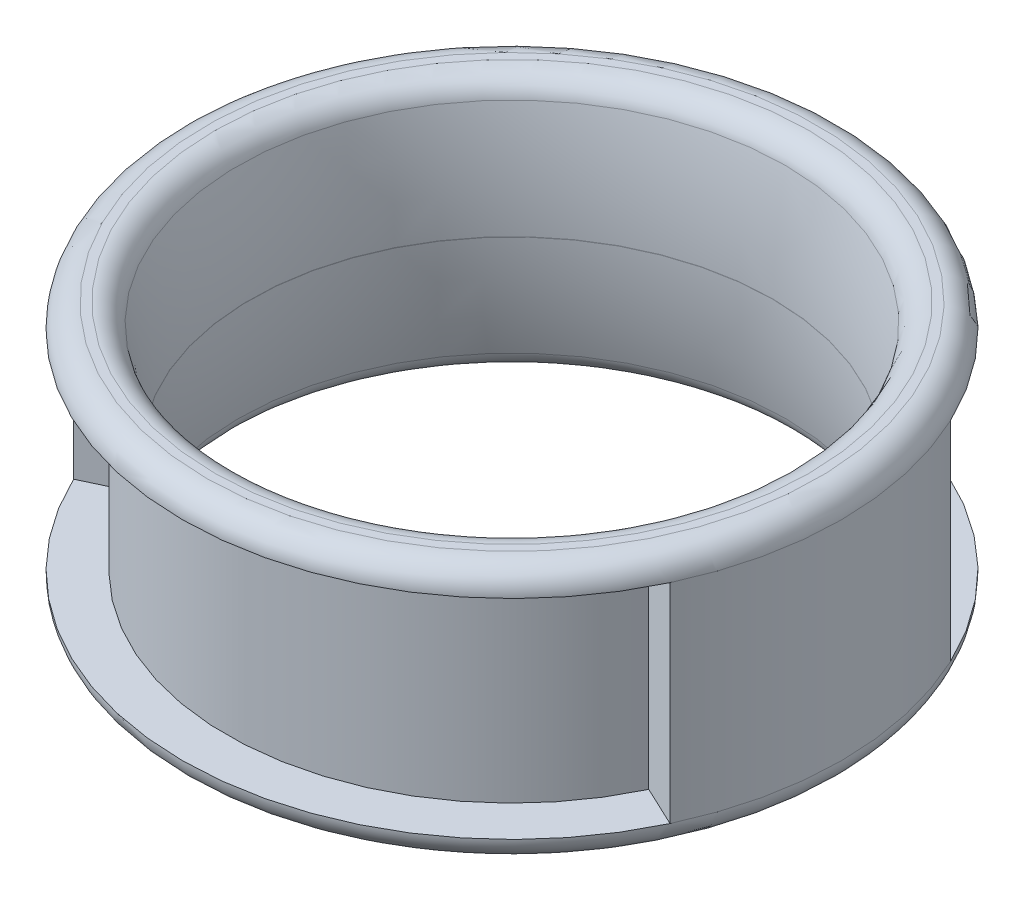
ISO-10303-21;
HEADER;
FILE_DESCRIPTION(('STEP AP214'),'2;1');
FILE_NAME('part.step','',(''),(''),'','','');
FILE_SCHEMA(('AUTOMOTIVE_DESIGN { 1 0 10303 214 1 1 1 1 }'));
ENDSEC;
DATA;
#1=APPLICATION_CONTEXT('core data for automotive mechanical design processes');
#2=APPLICATION_PROTOCOL_DEFINITION('international standard','automotive_design',2000,#1);
#3=PRODUCT_CONTEXT('',#1,'mechanical');
#4=PRODUCT('Part','Part','',(#3));
#5=PRODUCT_RELATED_PRODUCT_CATEGORY('part','',(#4));
#6=PRODUCT_DEFINITION_FORMATION('','',#4);
#7=PRODUCT_DEFINITION_CONTEXT('part definition',#1,'design');
#8=PRODUCT_DEFINITION('design','',#6,#7);
#9=PRODUCT_DEFINITION_SHAPE('','',#8);
#10=(LENGTH_UNIT() NAMED_UNIT(*) SI_UNIT(.MILLI.,.METRE.));
#11=(NAMED_UNIT(*) PLANE_ANGLE_UNIT() SI_UNIT($,.RADIAN.));
#12=(NAMED_UNIT(*) SI_UNIT($,.STERADIAN.) SOLID_ANGLE_UNIT());
#13=UNCERTAINTY_MEASURE_WITH_UNIT(LENGTH_MEASURE(1.E-05),#10,'distance_accuracy_value','');
#14=(GEOMETRIC_REPRESENTATION_CONTEXT(3) GLOBAL_UNCERTAINTY_ASSIGNED_CONTEXT((#13)) GLOBAL_UNIT_ASSIGNED_CONTEXT((#10,
#11,#12)) REPRESENTATION_CONTEXT('',''));
#15=CARTESIAN_POINT('',(0.,0.,0.));
#16=DIRECTION('',(0.,0.,1.));
#17=DIRECTION('',(1.,0.,0.));
#18=AXIS2_PLACEMENT_3D('',#15,#16,#17);
#19=CARTESIAN_POINT('',(0.,-3.75,0.));
#20=DIRECTION('',(0.,1.,0.));
#21=DIRECTION('',(0.,0.,1.));
#22=AXIS2_PLACEMENT_3D('',#19,#20,#21);
#23=CYLINDRICAL_SURFACE('',#22,9.635);
#24=CARTESIAN_POINT('',(0.,-3.05,0.));
#25=DIRECTION('',(0.,1.,0.));
#26=DIRECTION('',(0.,0.,1.));
#27=AXIS2_PLACEMENT_3D('',#24,#25,#26);
#28=CIRCLE('',#27,9.635);
#29=CARTESIAN_POINT('',(-8.71979782303053,-3.05,-4.09857913495298));
#30=VERTEX_POINT('',#29);
#31=CARTESIAN_POINT('',(-8.71979782303053,-3.05,4.09857913495298));
#32=VERTEX_POINT('',#31);
#33=EDGE_CURVE('E168',#30,#32,#28,.T.);
#34=ORIENTED_EDGE('',*,*,#33,.T.);
#35=DIRECTION('',(0.,1.,0.));
#36=VECTOR('',#35,1.);
#37=CARTESIAN_POINT('',(-8.71979782303053,3.05,4.09857913495298));
#38=LINE('',#37,#36);
#39=CARTESIAN_POINT('',(-8.71979782303053,3.05,4.09857913495298));
#40=VERTEX_POINT('',#39);
#41=EDGE_CURVE('E235',#32,#40,#38,.T.);
#42=ORIENTED_EDGE('',*,*,#41,.T.);
#43=CARTESIAN_POINT('',(0.,3.05,0.));
#44=DIRECTION('',(0.,1.,0.));
#45=DIRECTION('',(0.,0.,1.));
#46=AXIS2_PLACEMENT_3D('',#43,#44,#45);
#47=CIRCLE('',#46,9.635);
#48=CARTESIAN_POINT('',(-8.71979782303053,3.05,-4.09857913495298));
#49=VERTEX_POINT('',#48);
#50=EDGE_CURVE('E58',#40,#49,#47,.F.);
#51=ORIENTED_EDGE('',*,*,#50,.T.);
#52=DIRECTION('',(0.,1.,0.));
#53=VECTOR('',#52,1.);
#54=CARTESIAN_POINT('',(-8.71979782303053,3.05,-4.09857913495298));
#55=LINE('',#54,#53);
#56=EDGE_CURVE('E137',#30,#49,#55,.T.);
#57=ORIENTED_EDGE('',*,*,#56,.F.);
#58=EDGE_LOOP('',(#34,#42,#51,#57));
#59=FACE_BOUND('',#58,.T.);
#60=ADVANCED_FACE('F35',(#59),#23,.T.);
#61=CARTESIAN_POINT('',(0.,-3.75,0.));
#62=DIRECTION('',(0.,1.,0.));
#63=DIRECTION('',(0.,0.,1.));
#64=AXIS2_PLACEMENT_3D('',#61,#62,#63);
#65=CYLINDRICAL_SURFACE('',#64,7.635);
#66=CARTESIAN_POINT('',(0.,0.0049999999999998,0.));
#67=DIRECTION('',(0.,-1.,0.));
#68=DIRECTION('',(0.,0.,-1.));
#69=AXIS2_PLACEMENT_3D('',#66,#67,#68);
#70=CIRCLE('',#69,7.635);
#71=CARTESIAN_POINT('',(0.,0.0049999999999998,-7.635));
#72=VERTEX_POINT('',#71);
#73=EDGE_CURVE('E158',#72,#72,#70,.T.);
#74=ORIENTED_EDGE('',*,*,#73,.F.);
#75=EDGE_LOOP('',(#74));
#76=FACE_BOUND('',#75,.T.);
#77=CARTESIAN_POINT('',(0.,-0.00500000000000148,0.));
#78=DIRECTION('',(0.,-1.,0.));
#79=DIRECTION('',(0.,0.,-1.));
#80=AXIS2_PLACEMENT_3D('',#77,#78,#79);
#81=CIRCLE('',#80,7.635);
#82=CARTESIAN_POINT('',(0.,-0.00500000000000148,-7.635));
#83=VERTEX_POINT('',#82);
#84=EDGE_CURVE('E155',#83,#83,#81,.T.);
#85=ORIENTED_EDGE('',*,*,#84,.T.);
#86=EDGE_LOOP('',(#85));
#87=FACE_BOUND('',#86,.T.);
#88=ADVANCED_FACE('F200',(#76,#87),#65,.F.);
#89=CARTESIAN_POINT('',(0.,-3.75,0.));
#90=DIRECTION('',(0.,1.,0.));
#91=DIRECTION('',(0.,0.,1.));
#92=AXIS2_PLACEMENT_3D('',#89,#90,#91);
#93=PLANE('',#92);
#94=CARTESIAN_POINT('',(0.,-3.75,0.));
#95=DIRECTION('',(0.,1.,0.));
#96=DIRECTION('',(0.,0.,1.));
#97=AXIS2_PLACEMENT_3D('',#94,#95,#96);
#98=CIRCLE('',#97,8.68408216759765);
#99=CARTESIAN_POINT('',(0.,-3.75,8.68408216759765));
#100=VERTEX_POINT('',#99);
#101=EDGE_CURVE('E177',#100,#100,#98,.T.);
#102=ORIENTED_EDGE('',*,*,#101,.T.);
#103=EDGE_LOOP('',(#102));
#104=FACE_BOUND('',#103,.T.);
#105=CARTESIAN_POINT('',(0.,-3.75,0.));
#106=DIRECTION('',(0.,1.,0.));
#107=DIRECTION('',(0.,0.,1.));
#108=AXIS2_PLACEMENT_3D('',#105,#106,#107);
#109=CIRCLE('',#108,8.935);
#110=CARTESIAN_POINT('',(0.,-3.75,8.935));
#111=VERTEX_POINT('',#110);
#112=EDGE_CURVE('E167',#111,#111,#109,.F.);
#113=ORIENTED_EDGE('',*,*,#112,.T.);
#114=EDGE_LOOP('',(#113));
#115=FACE_BOUND('',#114,.T.);
#116=ADVANCED_FACE('F206',(#104,#115),#93,.F.);
#117=CARTESIAN_POINT('',(0.,3.75,0.));
#118=DIRECTION('',(0.,1.,0.));
#119=DIRECTION('',(0.,0.,1.));
#120=AXIS2_PLACEMENT_3D('',#117,#118,#119);
#121=PLANE('',#120);
#122=CARTESIAN_POINT('',(0.,3.75,0.));
#123=DIRECTION('',(0.,1.,0.));
#124=DIRECTION('',(0.,0.,1.));
#125=AXIS2_PLACEMENT_3D('',#122,#123,#124);
#126=CIRCLE('',#125,8.68408216759765);
#127=CARTESIAN_POINT('',(0.,3.75,8.68408216759765));
#128=VERTEX_POINT('',#127);
#129=EDGE_CURVE('E43',#128,#128,#126,.F.);
#130=ORIENTED_EDGE('',*,*,#129,.T.);
#131=EDGE_LOOP('',(#130));
#132=FACE_BOUND('',#131,.T.);
#133=CARTESIAN_POINT('',(0.,3.75,0.));
#134=DIRECTION('',(0.,1.,0.));
#135=DIRECTION('',(0.,0.,1.));
#136=AXIS2_PLACEMENT_3D('',#133,#134,#135);
#137=CIRCLE('',#136,8.935);
#138=CARTESIAN_POINT('',(0.,3.75,8.935));
#139=VERTEX_POINT('',#138);
#140=EDGE_CURVE('E171',#139,#139,#137,.T.);
#141=ORIENTED_EDGE('',*,*,#140,.T.);
#142=EDGE_LOOP('',(#141));
#143=FACE_BOUND('',#142,.T.);
#144=ADVANCED_FACE('F182',(#132,#143),#121,.T.);
#145=DIRECTION('',(0.,1.,0.));
#146=VECTOR('',#145,1.);
#147=CARTESIAN_POINT('',(8.71979782303053,3.05,4.09857913495298));
#148=LINE('',#147,#146);
#149=CARTESIAN_POINT('',(8.71979782303053,-3.05,4.09857913495298));
#150=VERTEX_POINT('',#149);
#151=CARTESIAN_POINT('',(8.71979782303054,3.05,4.09857913495298));
#152=VERTEX_POINT('',#151);
#153=EDGE_CURVE('E224',#150,#152,#148,.T.);
#154=ORIENTED_EDGE('',*,*,#153,.F.);
#155=CARTESIAN_POINT('',(8.71979782303053,-3.05,-4.09857913495298));
#156=VERTEX_POINT('',#155);
#157=EDGE_CURVE('E163',#150,#156,#28,.T.);
#158=ORIENTED_EDGE('',*,*,#157,.T.);
#159=DIRECTION('',(0.,1.,0.));
#160=VECTOR('',#159,1.);
#161=CARTESIAN_POINT('',(8.71979782303053,3.05,-4.09857913495298));
#162=LINE('',#161,#160);
#163=CARTESIAN_POINT('',(8.71979782303053,3.05,-4.09857913495298));
#164=VERTEX_POINT('',#163);
#165=EDGE_CURVE('E148',#156,#164,#162,.T.);
#166=ORIENTED_EDGE('',*,*,#165,.T.);
#167=EDGE_CURVE('E164',#164,#152,#47,.F.);
#168=ORIENTED_EDGE('',*,*,#167,.T.);
#169=EDGE_LOOP('',(#154,#158,#166,#168));
#170=FACE_BOUND('',#169,.T.);
#171=ADVANCED_FACE('F202',(#170),#23,.T.);
#172=CARTESIAN_POINT('',(0.,-3.05,0.));
#173=DIRECTION('',(0.,1.,0.));
#174=DIRECTION('',(0.,0.,1.));
#175=AXIS2_PLACEMENT_3D('',#172,#173,#174);
#176=TOROIDAL_SURFACE('',#175,8.935,0.7);
#177=ORIENTED_EDGE('',*,*,#112,.F.);
#178=EDGE_LOOP('',(#177));
#179=FACE_BOUND('',#178,.T.);
#180=EDGE_CURVE('E165',#156,#30,#28,.T.);
#181=ORIENTED_EDGE('',*,*,#180,.F.);
#182=ORIENTED_EDGE('',*,*,#157,.F.);
#183=CARTESIAN_POINT('',(0.,-3.05,0.));
#184=DIRECTION('',(0.,-1.,0.));
#185=DIRECTION('',(0.,0.,-1.));
#186=AXIS2_PLACEMENT_3D('',#183,#184,#185);
#187=CIRCLE('',#186,9.635);
#188=EDGE_CURVE('E128',#150,#32,#187,.T.);
#189=ORIENTED_EDGE('',*,*,#188,.T.);
#190=ORIENTED_EDGE('',*,*,#33,.F.);
#191=EDGE_LOOP('',(#181,#182,#189,#190));
#192=FACE_BOUND('',#191,.T.);
#193=ADVANCED_FACE('F213',(#179,#192),#176,.T.);
#194=CARTESIAN_POINT('',(0.,3.05,0.));
#195=DIRECTION('',(0.,1.,0.));
#196=DIRECTION('',(0.,0.,1.));
#197=AXIS2_PLACEMENT_3D('',#194,#195,#196);
#198=TOROIDAL_SURFACE('',#197,8.935,0.7);
#199=EDGE_CURVE('E161',#49,#164,#47,.F.);
#200=ORIENTED_EDGE('',*,*,#199,.F.);
#201=ORIENTED_EDGE('',*,*,#50,.F.);
#202=CARTESIAN_POINT('',(0.,3.05,0.));
#203=DIRECTION('',(0.,-1.,0.));
#204=DIRECTION('',(0.,0.,-1.));
#205=AXIS2_PLACEMENT_3D('',#202,#203,#204);
#206=CIRCLE('',#205,9.635);
#207=EDGE_CURVE('E117',#152,#40,#206,.T.);
#208=ORIENTED_EDGE('',*,*,#207,.F.);
#209=ORIENTED_EDGE('',*,*,#167,.F.);
#210=EDGE_LOOP('',(#200,#201,#208,#209));
#211=FACE_BOUND('',#210,.T.);
#212=ORIENTED_EDGE('',*,*,#140,.F.);
#213=EDGE_LOOP('',(#212));
#214=FACE_BOUND('',#213,.T.);
#215=ADVANCED_FACE('F219',(#211,#214),#198,.T.);
#216=CARTESIAN_POINT('',(0.,-0.0917507307465048,0.));
#217=DIRECTION('',(0.,-1.,0.));
#218=DIRECTION('',(0.,0.,-1.));
#219=AXIS2_PLACEMENT_3D('',#216,#217,#218);
#220=TOROIDAL_SURFACE('',#219,22.6346879732913,15.);
#221=CARTESIAN_POINT('',(0.,3.20379199381277,0.));
#222=DIRECTION('',(0.,-1.,0.));
#223=DIRECTION('',(0.,0.,-1.));
#224=AXIS2_PLACEMENT_3D('',#221,#222,#223);
#225=CIRCLE('',#224,8.00118537990635);
#226=CARTESIAN_POINT('',(0.,3.20379199381277,-8.00118537990635));
#227=VERTEX_POINT('',#226);
#228=EDGE_CURVE('E11',#227,#227,#225,.F.);
#229=ORIENTED_EDGE('',*,*,#228,.T.);
#230=EDGE_LOOP('',(#229));
#231=FACE_BOUND('',#230,.T.);
#232=ORIENTED_EDGE('',*,*,#73,.T.);
#233=EDGE_LOOP('',(#232));
#234=FACE_BOUND('',#233,.T.);
#235=ADVANCED_FACE('F282',(#231,#234),#220,.T.);
#236=CARTESIAN_POINT('',(0.,0.0917507307465016,0.));
#237=DIRECTION('',(0.,-1.,0.));
#238=DIRECTION('',(0.,0.,-1.));
#239=AXIS2_PLACEMENT_3D('',#236,#237,#238);
#240=TOROIDAL_SURFACE('',#239,22.6346879732913,15.);
#241=CARTESIAN_POINT('',(0.,-3.20379199381277,0.));
#242=DIRECTION('',(0.,1.,0.));
#243=DIRECTION('',(0.,0.,1.));
#244=AXIS2_PLACEMENT_3D('',#241,#242,#243);
#245=CIRCLE('',#244,8.00118537990635);
#246=CARTESIAN_POINT('',(0.,-3.20379199381277,8.00118537990635));
#247=VERTEX_POINT('',#246);
#248=EDGE_CURVE('E174',#247,#247,#245,.F.);
#249=ORIENTED_EDGE('',*,*,#248,.T.);
#250=EDGE_LOOP('',(#249));
#251=FACE_BOUND('',#250,.T.);
#252=ORIENTED_EDGE('',*,*,#84,.F.);
#253=EDGE_LOOP('',(#252));
#254=FACE_BOUND('',#253,.T.);
#255=ADVANCED_FACE('F196',(#251,#254),#240,.T.);
#256=CARTESIAN_POINT('',(0.,-3.05,0.));
#257=DIRECTION('',(0.,-1.,0.));
#258=DIRECTION('',(0.,0.,-1.));
#259=AXIS2_PLACEMENT_3D('',#256,#257,#258);
#260=TOROIDAL_SURFACE('',#259,8.68408216759765,0.7);
#261=ORIENTED_EDGE('',*,*,#101,.F.);
#262=EDGE_LOOP('',(#261));
#263=FACE_BOUND('',#262,.T.);
#264=ORIENTED_EDGE('',*,*,#248,.F.);
#265=EDGE_LOOP('',(#264));
#266=FACE_BOUND('',#265,.T.);
#267=ADVANCED_FACE('F187',(#263,#266),#260,.T.);
#268=CARTESIAN_POINT('',(0.,3.05,0.));
#269=DIRECTION('',(0.,-1.,0.));
#270=DIRECTION('',(0.,0.,-1.));
#271=AXIS2_PLACEMENT_3D('',#268,#269,#270);
#272=TOROIDAL_SURFACE('',#271,8.68408216759765,0.7);
#273=ORIENTED_EDGE('',*,*,#228,.F.);
#274=EDGE_LOOP('',(#273));
#275=FACE_BOUND('',#274,.T.);
#276=ORIENTED_EDGE('',*,*,#129,.F.);
#277=EDGE_LOOP('',(#276));
#278=FACE_BOUND('',#277,.T.);
#279=ADVANCED_FACE('F37',(#275,#278),#272,.T.);
#280=CARTESIAN_POINT('',(8.71979782303053,3.05,-4.09857913495298));
#281=DIRECTION('',(0.,-1.,0.));
#282=DIRECTION('',(0.,0.,-1.));
#283=AXIS2_PLACEMENT_3D('',#280,#281,#282);
#284=PLANE('',#283);
#285=CARTESIAN_POINT('',(0.,3.05,0.));
#286=DIRECTION('',(0.,1.,0.));
#287=DIRECTION('',(0.,0.,1.));
#288=AXIS2_PLACEMENT_3D('',#285,#286,#287);
#289=CIRCLE('',#288,8.335);
#290=CARTESIAN_POINT('',(7.54328125116342,3.05,-3.54557935545751));
#291=VERTEX_POINT('',#290);
#292=CARTESIAN_POINT('',(-7.54328125116341,3.05,-3.54557935545751));
#293=VERTEX_POINT('',#292);
#294=EDGE_CURVE('E153',#291,#293,#289,.T.);
#295=ORIENTED_EDGE('',*,*,#294,.T.);
#296=DIRECTION('',(0.905012747590092,0.,0.425384445765748));
#297=VECTOR('',#296,1.);
#298=CARTESIAN_POINT('',(-8.71979782303053,3.05,-4.09857913495298));
#299=LINE('',#298,#297);
#300=EDGE_CURVE('E122',#49,#293,#299,.T.);
#301=ORIENTED_EDGE('',*,*,#300,.F.);
#302=ORIENTED_EDGE('',*,*,#199,.T.);
#303=DIRECTION('',(-0.905012747590092,0.,0.425384445765748));
#304=VECTOR('',#303,1.);
#305=CARTESIAN_POINT('',(8.71979782303053,3.05,-4.09857913495298));
#306=LINE('',#305,#304);
#307=EDGE_CURVE('E139',#164,#291,#306,.T.);
#308=ORIENTED_EDGE('',*,*,#307,.T.);
#309=EDGE_LOOP('',(#295,#301,#302,#308));
#310=FACE_BOUND('',#309,.T.);
#311=ADVANCED_FACE('F186',(#310),#284,.T.);
#312=CARTESIAN_POINT('',(0.,0.,0.));
#313=DIRECTION('',(0.,1.,0.));
#314=DIRECTION('',(0.,0.,1.));
#315=AXIS2_PLACEMENT_3D('',#312,#313,#314);
#316=CYLINDRICAL_SURFACE('',#315,8.335);
#317=CARTESIAN_POINT('',(0.,-3.05,0.));
#318=DIRECTION('',(0.,1.,0.));
#319=DIRECTION('',(0.,0.,1.));
#320=AXIS2_PLACEMENT_3D('',#317,#318,#319);
#321=CIRCLE('',#320,8.335);
#322=CARTESIAN_POINT('',(7.54328125116342,-3.05,-3.54557935545751));
#323=VERTEX_POINT('',#322);
#324=CARTESIAN_POINT('',(-7.54328125116341,-3.05,-3.54557935545751));
#325=VERTEX_POINT('',#324);
#326=EDGE_CURVE('E151',#323,#325,#321,.T.);
#327=ORIENTED_EDGE('',*,*,#326,.T.);
#328=DIRECTION('',(0.,-1.,0.));
#329=VECTOR('',#328,1.);
#330=CARTESIAN_POINT('',(-7.54328125116341,3.05,-3.54557935545751));
#331=LINE('',#330,#329);
#332=EDGE_CURVE('E126',#293,#325,#331,.T.);
#333=ORIENTED_EDGE('',*,*,#332,.F.);
#334=ORIENTED_EDGE('',*,*,#294,.F.);
#335=DIRECTION('',(0.,-1.,0.));
#336=VECTOR('',#335,1.);
#337=CARTESIAN_POINT('',(7.54328125116342,3.05,-3.54557935545751));
#338=LINE('',#337,#336);
#339=EDGE_CURVE('E142',#291,#323,#338,.T.);
#340=ORIENTED_EDGE('',*,*,#339,.T.);
#341=EDGE_LOOP('',(#327,#333,#334,#340));
#342=FACE_BOUND('',#341,.T.);
#343=ADVANCED_FACE('F193',(#342),#316,.T.);
#344=CARTESIAN_POINT('',(8.71979782303053,-3.05,-4.09857913495298));
#345=DIRECTION('',(0.,1.,0.));
#346=DIRECTION('',(0.,0.,1.));
#347=AXIS2_PLACEMENT_3D('',#344,#345,#346);
#348=PLANE('',#347);
#349=ORIENTED_EDGE('',*,*,#180,.T.);
#350=DIRECTION('',(-0.905012747590092,0.,-0.425384445765748));
#351=VECTOR('',#350,1.);
#352=CARTESIAN_POINT('',(-8.71979782303053,-3.05,-4.09857913495298));
#353=LINE('',#352,#351);
#354=EDGE_CURVE('E134',#325,#30,#353,.T.);
#355=ORIENTED_EDGE('',*,*,#354,.F.);
#356=ORIENTED_EDGE('',*,*,#326,.F.);
#357=DIRECTION('',(0.905012747590092,0.,-0.425384445765748));
#358=VECTOR('',#357,1.);
#359=CARTESIAN_POINT('',(8.71979782303053,-3.05,-4.09857913495298));
#360=LINE('',#359,#358);
#361=EDGE_CURVE('E145',#323,#156,#360,.T.);
#362=ORIENTED_EDGE('',*,*,#361,.T.);
#363=EDGE_LOOP('',(#349,#355,#356,#362));
#364=FACE_BOUND('',#363,.T.);
#365=ADVANCED_FACE('F271',(#364),#348,.T.);
#366=CARTESIAN_POINT('',(0.,0.,0.));
#367=DIRECTION('',(0.425384445765748,0.,0.905012747590092));
#368=DIRECTION('',(0.905012747590092,0.,-0.425384445765748));
#369=AXIS2_PLACEMENT_3D('',#366,#367,#368);
#370=PLANE('',#369);
#371=ORIENTED_EDGE('',*,*,#307,.F.);
#372=ORIENTED_EDGE('',*,*,#165,.F.);
#373=ORIENTED_EDGE('',*,*,#361,.F.);
#374=ORIENTED_EDGE('',*,*,#339,.F.);
#375=EDGE_LOOP('',(#371,#372,#373,#374));
#376=FACE_BOUND('',#375,.T.);
#377=ADVANCED_FACE('F269',(#376),#370,.F.);
#378=CARTESIAN_POINT('',(0.,0.,0.));
#379=DIRECTION('',(0.425384445765748,0.,-0.905012747590092));
#380=DIRECTION('',(-0.905012747590092,0.,-0.425384445765748));
#381=AXIS2_PLACEMENT_3D('',#378,#379,#380);
#382=PLANE('',#381);
#383=ORIENTED_EDGE('',*,*,#300,.T.);
#384=ORIENTED_EDGE('',*,*,#332,.T.);
#385=ORIENTED_EDGE('',*,*,#354,.T.);
#386=ORIENTED_EDGE('',*,*,#56,.T.);
#387=EDGE_LOOP('',(#383,#384,#385,#386));
#388=FACE_BOUND('',#387,.T.);
#389=ADVANCED_FACE('F238',(#388),#382,.T.);
#390=CARTESIAN_POINT('',(8.71979782303053,3.05,4.09857913495298));
#391=DIRECTION('',(0.,-1.,0.));
#392=DIRECTION('',(0.,0.,1.));
#393=AXIS2_PLACEMENT_3D('',#390,#391,#392);
#394=PLANE('',#393);
#395=CARTESIAN_POINT('',(0.,3.05,0.));
#396=DIRECTION('',(0.,-1.,0.));
#397=DIRECTION('',(0.,0.,-1.));
#398=AXIS2_PLACEMENT_3D('',#395,#396,#397);
#399=CIRCLE('',#398,8.335);
#400=CARTESIAN_POINT('',(7.54328125116342,3.05,3.54557935545751));
#401=VERTEX_POINT('',#400);
#402=CARTESIAN_POINT('',(-7.54328125116341,3.05,3.54557935545751));
#403=VERTEX_POINT('',#402);
#404=EDGE_CURVE('E115',#401,#403,#399,.T.);
#405=ORIENTED_EDGE('',*,*,#404,.F.);
#406=DIRECTION('',(-0.905012747590092,0.,-0.425384445765748));
#407=VECTOR('',#406,1.);
#408=CARTESIAN_POINT('',(8.71979782303053,3.05,4.09857913495298));
#409=LINE('',#408,#407);
#410=EDGE_CURVE('E50',#152,#401,#409,.T.);
#411=ORIENTED_EDGE('',*,*,#410,.F.);
#412=ORIENTED_EDGE('',*,*,#207,.T.);
#413=DIRECTION('',(0.905012747590092,0.,-0.425384445765748));
#414=VECTOR('',#413,1.);
#415=CARTESIAN_POINT('',(-8.71979782303053,3.05,4.09857913495298));
#416=LINE('',#415,#414);
#417=EDGE_CURVE('E106',#40,#403,#416,.T.);
#418=ORIENTED_EDGE('',*,*,#417,.T.);
#419=EDGE_LOOP('',(#405,#411,#412,#418));
#420=FACE_BOUND('',#419,.T.);
#421=ADVANCED_FACE('F114',(#420),#394,.T.);
#422=CARTESIAN_POINT('',(0.,0.,0.));
#423=DIRECTION('',(0.,1.,0.));
#424=DIRECTION('',(0.,0.,-1.));
#425=AXIS2_PLACEMENT_3D('',#422,#423,#424);
#426=CYLINDRICAL_SURFACE('',#425,8.335);
#427=CARTESIAN_POINT('',(0.,-3.05,0.));
#428=DIRECTION('',(0.,-1.,0.));
#429=DIRECTION('',(0.,0.,-1.));
#430=AXIS2_PLACEMENT_3D('',#427,#428,#429);
#431=CIRCLE('',#430,8.335);
#432=CARTESIAN_POINT('',(7.54328125116342,-3.05,3.54557935545751));
#433=VERTEX_POINT('',#432);
#434=CARTESIAN_POINT('',(-7.54328125116341,-3.05,3.54557935545751));
#435=VERTEX_POINT('',#434);
#436=EDGE_CURVE('E123',#433,#435,#431,.T.);
#437=ORIENTED_EDGE('',*,*,#436,.F.);
#438=DIRECTION('',(0.,-1.,0.));
#439=VECTOR('',#438,1.);
#440=CARTESIAN_POINT('',(7.54328125116342,3.05,3.54557935545751));
#441=LINE('',#440,#439);
#442=EDGE_CURVE('E121',#401,#433,#441,.T.);
#443=ORIENTED_EDGE('',*,*,#442,.F.);
#444=ORIENTED_EDGE('',*,*,#404,.T.);
#445=DIRECTION('',(0.,-1.,0.));
#446=VECTOR('',#445,1.);
#447=CARTESIAN_POINT('',(-7.54328125116341,3.05,3.54557935545751));
#448=LINE('',#447,#446);
#449=EDGE_CURVE('E103',#403,#435,#448,.T.);
#450=ORIENTED_EDGE('',*,*,#449,.T.);
#451=EDGE_LOOP('',(#437,#443,#444,#450));
#452=FACE_BOUND('',#451,.T.);
#453=ADVANCED_FACE('F119',(#452),#426,.T.);
#454=CARTESIAN_POINT('',(8.71979782303053,-3.05,4.09857913495298));
#455=DIRECTION('',(0.,1.,0.));
#456=DIRECTION('',(0.,0.,-1.));
#457=AXIS2_PLACEMENT_3D('',#454,#455,#456);
#458=PLANE('',#457);
#459=ORIENTED_EDGE('',*,*,#188,.F.);
#460=DIRECTION('',(0.905012747590092,0.,0.425384445765748));
#461=VECTOR('',#460,1.);
#462=CARTESIAN_POINT('',(8.71979782303053,-3.05,4.09857913495298));
#463=LINE('',#462,#461);
#464=EDGE_CURVE('E228',#433,#150,#463,.T.);
#465=ORIENTED_EDGE('',*,*,#464,.F.);
#466=ORIENTED_EDGE('',*,*,#436,.T.);
#467=DIRECTION('',(-0.905012747590092,0.,0.425384445765748));
#468=VECTOR('',#467,1.);
#469=CARTESIAN_POINT('',(-8.71979782303053,-3.05,4.09857913495298));
#470=LINE('',#469,#468);
#471=EDGE_CURVE('E108',#435,#32,#470,.T.);
#472=ORIENTED_EDGE('',*,*,#471,.T.);
#473=EDGE_LOOP('',(#459,#465,#466,#472));
#474=FACE_BOUND('',#473,.T.);
#475=ADVANCED_FACE('F252',(#474),#458,.T.);
#476=CARTESIAN_POINT('',(0.,0.,0.));
#477=DIRECTION('',(0.425384445765748,0.,-0.905012747590092));
#478=DIRECTION('',(0.905012747590092,0.,0.425384445765748));
#479=AXIS2_PLACEMENT_3D('',#476,#477,#478);
#480=PLANE('',#479);
#481=ORIENTED_EDGE('',*,*,#410,.T.);
#482=ORIENTED_EDGE('',*,*,#442,.T.);
#483=ORIENTED_EDGE('',*,*,#464,.T.);
#484=ORIENTED_EDGE('',*,*,#153,.T.);
#485=EDGE_LOOP('',(#481,#482,#483,#484));
#486=FACE_BOUND('',#485,.T.);
#487=ADVANCED_FACE('F253',(#486),#480,.F.);
#488=CARTESIAN_POINT('',(0.,0.,0.));
#489=DIRECTION('',(0.425384445765748,0.,0.905012747590092));
#490=DIRECTION('',(-0.905012747590092,0.,0.425384445765748));
#491=AXIS2_PLACEMENT_3D('',#488,#489,#490);
#492=PLANE('',#491);
#493=ORIENTED_EDGE('',*,*,#417,.F.);
#494=ORIENTED_EDGE('',*,*,#41,.F.);
#495=ORIENTED_EDGE('',*,*,#471,.F.);
#496=ORIENTED_EDGE('',*,*,#449,.F.);
#497=EDGE_LOOP('',(#493,#494,#495,#496));
#498=FACE_BOUND('',#497,.T.);
#499=ADVANCED_FACE('F105',(#498),#492,.T.);
#500=CLOSED_SHELL('',(#60,#88,#116,#144,#171,#193,#215,#235,#255,#267,#279,#311,#343,#365,#377,
#389,#421,#453,#475,#487,#499));
#501=MANIFOLD_SOLID_BREP('B2',#500);
#502=ADVANCED_BREP_SHAPE_REPRESENTATION('',(#18,#501),#14);
#503=SHAPE_DEFINITION_REPRESENTATION(#9,#502);
ENDSEC;
END-ISO-10303-21;
